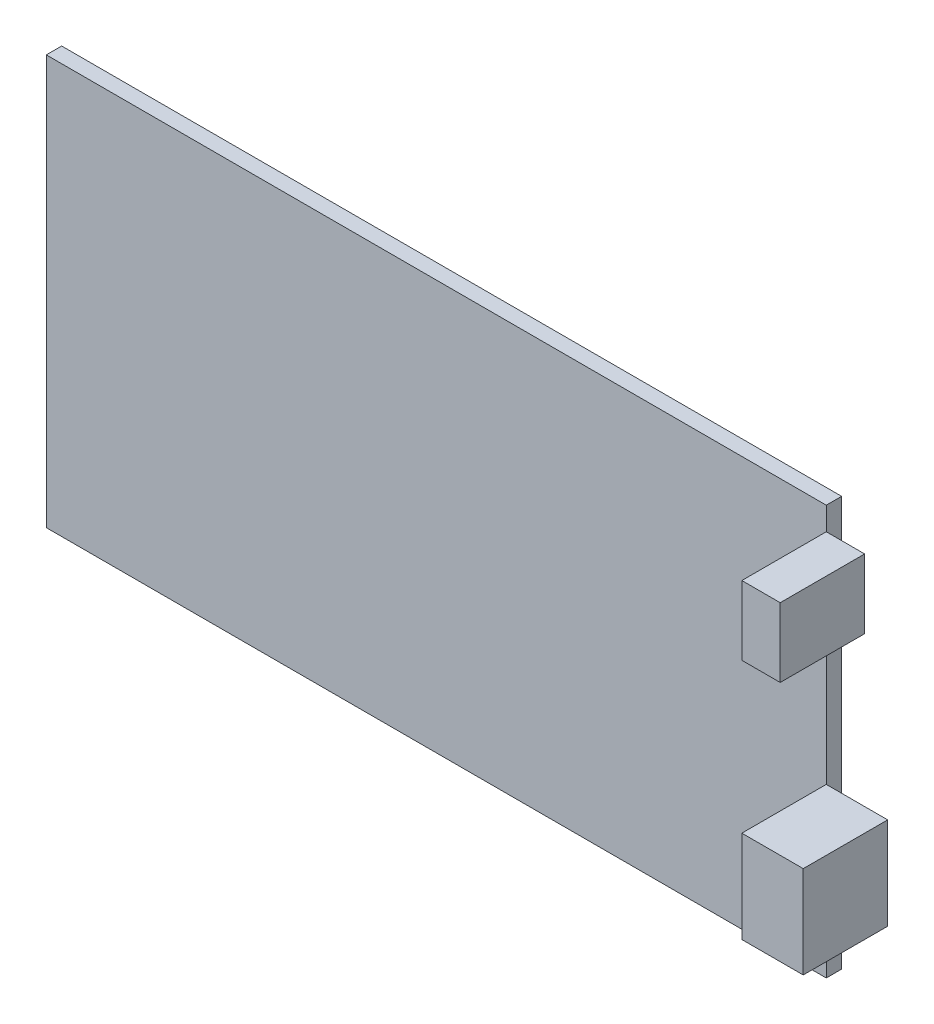
ISO-10303-21;
HEADER;
FILE_DESCRIPTION(('STEP AP214'),'2;1');
FILE_NAME('part.step','',(''),(''),'','','');
FILE_SCHEMA(('AUTOMOTIVE_DESIGN { 1 0 10303 214 1 1 1 1 }'));
ENDSEC;
DATA;
#1=APPLICATION_CONTEXT('core data for automotive mechanical design processes');
#2=APPLICATION_PROTOCOL_DEFINITION('international standard','automotive_design',2000,#1);
#3=PRODUCT_CONTEXT('',#1,'mechanical');
#4=PRODUCT('Part','Part','',(#3));
#5=PRODUCT_RELATED_PRODUCT_CATEGORY('part','',(#4));
#6=PRODUCT_DEFINITION_FORMATION('','',#4);
#7=PRODUCT_DEFINITION_CONTEXT('part definition',#1,'design');
#8=PRODUCT_DEFINITION('design','',#6,#7);
#9=PRODUCT_DEFINITION_SHAPE('','',#8);
#10=(LENGTH_UNIT() NAMED_UNIT(*) SI_UNIT(.MILLI.,.METRE.));
#11=(NAMED_UNIT(*) PLANE_ANGLE_UNIT() SI_UNIT($,.RADIAN.));
#12=(NAMED_UNIT(*) SI_UNIT($,.STERADIAN.) SOLID_ANGLE_UNIT());
#13=UNCERTAINTY_MEASURE_WITH_UNIT(LENGTH_MEASURE(1.E-05),#10,'distance_accuracy_value','');
#14=(GEOMETRIC_REPRESENTATION_CONTEXT(3) GLOBAL_UNCERTAINTY_ASSIGNED_CONTEXT((#13)) GLOBAL_UNIT_ASSIGNED_CONTEXT((#10,
#11,#12)) REPRESENTATION_CONTEXT('',''));
#15=CARTESIAN_POINT('',(0.,0.,0.));
#16=DIRECTION('',(0.,0.,1.));
#17=DIRECTION('',(1.,0.,0.));
#18=AXIS2_PLACEMENT_3D('',#15,#16,#17);
#19=CARTESIAN_POINT('',(106.6,21.84,2.));
#20=DIRECTION('',(0.,0.,1.));
#21=DIRECTION('',(0.,-1.,0.));
#22=AXIS2_PLACEMENT_3D('',#19,#20,#21);
#23=PLANE('',#22);
#24=DIRECTION('',(0.,1.,0.));
#25=VECTOR('',#24,1.);
#26=CARTESIAN_POINT('',(101.6,21.84,2.));
#27=LINE('',#26,#25);
#28=CARTESIAN_POINT('',(101.6,9.84,2.));
#29=VERTEX_POINT('',#28);
#30=CARTESIAN_POINT('',(101.6,21.84,2.));
#31=VERTEX_POINT('',#30);
#32=EDGE_CURVE('E120',#29,#31,#27,.T.);
#33=ORIENTED_EDGE('',*,*,#32,.T.);
#34=DIRECTION('',(-1.,0.,0.));
#35=VECTOR('',#34,1.);
#36=CARTESIAN_POINT('',(106.6,21.84,2.));
#37=LINE('',#36,#35);
#38=CARTESIAN_POINT('',(109.6,21.84,2.));
#39=VERTEX_POINT('',#38);
#40=EDGE_CURVE('E12',#39,#31,#37,.T.);
#41=ORIENTED_EDGE('',*,*,#40,.F.);
#42=DIRECTION('',(0.,1.,0.));
#43=VECTOR('',#42,1.);
#44=CARTESIAN_POINT('',(109.6,9.84,2.));
#45=LINE('',#44,#43);
#46=CARTESIAN_POINT('',(109.6,9.84,2.));
#47=VERTEX_POINT('',#46);
#48=EDGE_CURVE('E106',#47,#39,#45,.T.);
#49=ORIENTED_EDGE('',*,*,#48,.F.);
#50=DIRECTION('',(-1.,0.,0.));
#51=VECTOR('',#50,1.);
#52=CARTESIAN_POINT('',(106.6,9.84,2.));
#53=LINE('',#52,#51);
#54=EDGE_CURVE('E95',#47,#29,#53,.T.);
#55=ORIENTED_EDGE('',*,*,#54,.T.);
#56=EDGE_LOOP('',(#33,#41,#49,#55));
#57=FACE_BOUND('',#56,.T.);
#58=ADVANCED_FACE('F56',(#57),#23,.F.);
#59=CARTESIAN_POINT('',(106.6,21.84,2.));
#60=DIRECTION('',(0.,-1.,0.));
#61=DIRECTION('',(0.,0.,-1.));
#62=AXIS2_PLACEMENT_3D('',#59,#60,#61);
#63=PLANE('',#62);
#64=DIRECTION('',(0.,0.,1.));
#65=VECTOR('',#64,1.);
#66=CARTESIAN_POINT('',(101.6,21.84,2.));
#67=LINE('',#66,#65);
#68=CARTESIAN_POINT('',(101.6,21.84,13.));
#69=VERTEX_POINT('',#68);
#70=EDGE_CURVE('E122',#31,#69,#67,.T.);
#71=ORIENTED_EDGE('',*,*,#70,.T.);
#72=DIRECTION('',(-1.,0.,0.));
#73=VECTOR('',#72,1.);
#74=CARTESIAN_POINT('',(106.6,21.84,13.));
#75=LINE('',#74,#73);
#76=CARTESIAN_POINT('',(109.6,21.84,13.));
#77=VERTEX_POINT('',#76);
#78=EDGE_CURVE('E63',#77,#69,#75,.T.);
#79=ORIENTED_EDGE('',*,*,#78,.F.);
#80=DIRECTION('',(0.,0.,1.));
#81=VECTOR('',#80,1.);
#82=CARTESIAN_POINT('',(109.6,21.84,2.));
#83=LINE('',#82,#81);
#84=EDGE_CURVE('E110',#39,#77,#83,.T.);
#85=ORIENTED_EDGE('',*,*,#84,.F.);
#86=ORIENTED_EDGE('',*,*,#40,.T.);
#87=EDGE_LOOP('',(#71,#79,#85,#86));
#88=FACE_BOUND('',#87,.T.);
#89=ADVANCED_FACE('F130',(#88),#63,.F.);
#90=CARTESIAN_POINT('',(106.6,21.84,13.));
#91=DIRECTION('',(0.,0.,-1.));
#92=DIRECTION('',(0.,1.,0.));
#93=AXIS2_PLACEMENT_3D('',#90,#91,#92);
#94=PLANE('',#93);
#95=DIRECTION('',(0.,-1.,0.));
#96=VECTOR('',#95,1.);
#97=CARTESIAN_POINT('',(101.6,21.84,13.));
#98=LINE('',#97,#96);
#99=CARTESIAN_POINT('',(101.6,9.84,13.));
#100=VERTEX_POINT('',#99);
#101=EDGE_CURVE('E78',#69,#100,#98,.T.);
#102=ORIENTED_EDGE('',*,*,#101,.T.);
#103=DIRECTION('',(-1.,0.,0.));
#104=VECTOR('',#103,1.);
#105=CARTESIAN_POINT('',(106.6,9.84,13.));
#106=LINE('',#105,#104);
#107=CARTESIAN_POINT('',(109.6,9.84,13.));
#108=VERTEX_POINT('',#107);
#109=EDGE_CURVE('E103',#108,#100,#106,.T.);
#110=ORIENTED_EDGE('',*,*,#109,.F.);
#111=DIRECTION('',(0.,-1.,0.));
#112=VECTOR('',#111,1.);
#113=CARTESIAN_POINT('',(109.6,21.84,13.));
#114=LINE('',#113,#112);
#115=EDGE_CURVE('E115',#77,#108,#114,.T.);
#116=ORIENTED_EDGE('',*,*,#115,.F.);
#117=ORIENTED_EDGE('',*,*,#78,.T.);
#118=EDGE_LOOP('',(#102,#110,#116,#117));
#119=FACE_BOUND('',#118,.T.);
#120=ADVANCED_FACE('F126',(#119),#94,.F.);
#121=CARTESIAN_POINT('',(106.6,9.84,2.));
#122=DIRECTION('',(0.,1.,0.));
#123=DIRECTION('',(0.,0.,1.));
#124=AXIS2_PLACEMENT_3D('',#121,#122,#123);
#125=PLANE('',#124);
#126=DIRECTION('',(0.,0.,-1.));
#127=VECTOR('',#126,1.);
#128=CARTESIAN_POINT('',(101.6,9.84,2.));
#129=LINE('',#128,#127);
#130=EDGE_CURVE('E70',#100,#29,#129,.T.);
#131=ORIENTED_EDGE('',*,*,#130,.T.);
#132=ORIENTED_EDGE('',*,*,#54,.F.);
#133=DIRECTION('',(0.,0.,-1.));
#134=VECTOR('',#133,1.);
#135=CARTESIAN_POINT('',(109.6,9.84,13.));
#136=LINE('',#135,#134);
#137=EDGE_CURVE('E99',#108,#47,#136,.T.);
#138=ORIENTED_EDGE('',*,*,#137,.F.);
#139=ORIENTED_EDGE('',*,*,#109,.T.);
#140=EDGE_LOOP('',(#131,#132,#138,#139));
#141=FACE_BOUND('',#140,.T.);
#142=ADVANCED_FACE('F97',(#141),#125,.F.);
#143=CARTESIAN_POINT('',(101.6,0.,0.));
#144=DIRECTION('',(-1.,0.,0.));
#145=DIRECTION('',(0.,0.,1.));
#146=AXIS2_PLACEMENT_3D('',#143,#144,#145);
#147=PLANE('',#146);
#148=ORIENTED_EDGE('',*,*,#32,.F.);
#149=ORIENTED_EDGE('',*,*,#130,.F.);
#150=ORIENTED_EDGE('',*,*,#101,.F.);
#151=ORIENTED_EDGE('',*,*,#70,.F.);
#152=EDGE_LOOP('',(#148,#149,#150,#151));
#153=FACE_BOUND('',#152,.T.);
#154=ADVANCED_FACE('F129',(#153),#147,.T.);
#155=CARTESIAN_POINT('',(109.6,0.,0.));
#156=DIRECTION('',(1.,0.,0.));
#157=DIRECTION('',(0.,0.,-1.));
#158=AXIS2_PLACEMENT_3D('',#155,#156,#157);
#159=PLANE('',#158);
#160=ORIENTED_EDGE('',*,*,#137,.T.);
#161=ORIENTED_EDGE('',*,*,#48,.T.);
#162=ORIENTED_EDGE('',*,*,#84,.T.);
#163=ORIENTED_EDGE('',*,*,#115,.T.);
#164=EDGE_LOOP('',(#160,#161,#162,#163));
#165=FACE_BOUND('',#164,.T.);
#166=ADVANCED_FACE('F113',(#165),#159,.T.);
#167=CLOSED_SHELL('',(#58,#89,#120,#142,#154,#166));
#168=MANIFOLD_SOLID_BREP('B2',#167);
#169=CARTESIAN_POINT('',(106.6,50.34,2.));
#170=DIRECTION('',(0.,0.,1.));
#171=DIRECTION('',(0.,-1.,0.));
#172=AXIS2_PLACEMENT_3D('',#169,#170,#171);
#173=PLANE('',#172);
#174=DIRECTION('',(0.,1.,0.));
#175=VECTOR('',#174,1.);
#176=CARTESIAN_POINT('',(101.6,50.34,2.));
#177=LINE('',#176,#175);
#178=CARTESIAN_POINT('',(101.6,41.34,2.));
#179=VERTEX_POINT('',#178);
#180=CARTESIAN_POINT('',(101.6,50.34,2.));
#181=VERTEX_POINT('',#180);
#182=EDGE_CURVE('E264',#179,#181,#177,.T.);
#183=ORIENTED_EDGE('',*,*,#182,.T.);
#184=DIRECTION('',(-1.,0.,0.));
#185=VECTOR('',#184,1.);
#186=CARTESIAN_POINT('',(106.6,50.34,2.));
#187=LINE('',#186,#185);
#188=CARTESIAN_POINT('',(106.6,50.34,2.));
#189=VERTEX_POINT('',#188);
#190=EDGE_CURVE('E54',#189,#181,#187,.T.);
#191=ORIENTED_EDGE('',*,*,#190,.F.);
#192=DIRECTION('',(0.,1.,0.));
#193=VECTOR('',#192,1.);
#194=CARTESIAN_POINT('',(106.6,50.34,2.));
#195=LINE('',#194,#193);
#196=CARTESIAN_POINT('',(106.6,41.34,2.));
#197=VERTEX_POINT('',#196);
#198=EDGE_CURVE('E252',#197,#189,#195,.T.);
#199=ORIENTED_EDGE('',*,*,#198,.F.);
#200=DIRECTION('',(-1.,0.,0.));
#201=VECTOR('',#200,1.);
#202=CARTESIAN_POINT('',(106.6,41.34,2.));
#203=LINE('',#202,#201);
#204=EDGE_CURVE('E260',#197,#179,#203,.T.);
#205=ORIENTED_EDGE('',*,*,#204,.T.);
#206=EDGE_LOOP('',(#183,#191,#199,#205));
#207=FACE_BOUND('',#206,.T.);
#208=ADVANCED_FACE('F201',(#207),#173,.F.);
#209=CARTESIAN_POINT('',(106.6,50.34,2.));
#210=DIRECTION('',(0.,-1.,0.));
#211=DIRECTION('',(0.,0.,-1.));
#212=AXIS2_PLACEMENT_3D('',#209,#210,#211);
#213=PLANE('',#212);
#214=DIRECTION('',(0.,0.,1.));
#215=VECTOR('',#214,1.);
#216=CARTESIAN_POINT('',(101.6,50.34,2.));
#217=LINE('',#216,#215);
#218=CARTESIAN_POINT('',(101.6,50.34,13.));
#219=VERTEX_POINT('',#218);
#220=EDGE_CURVE('E256',#181,#219,#217,.T.);
#221=ORIENTED_EDGE('',*,*,#220,.T.);
#222=DIRECTION('',(-1.,0.,0.));
#223=VECTOR('',#222,1.);
#224=CARTESIAN_POINT('',(106.6,50.34,13.));
#225=LINE('',#224,#223);
#226=CARTESIAN_POINT('',(106.6,50.34,13.));
#227=VERTEX_POINT('',#226);
#228=EDGE_CURVE('E209',#227,#219,#225,.T.);
#229=ORIENTED_EDGE('',*,*,#228,.F.);
#230=DIRECTION('',(0.,0.,1.));
#231=VECTOR('',#230,1.);
#232=CARTESIAN_POINT('',(106.6,50.34,2.));
#233=LINE('',#232,#231);
#234=EDGE_CURVE('E247',#189,#227,#233,.T.);
#235=ORIENTED_EDGE('',*,*,#234,.F.);
#236=ORIENTED_EDGE('',*,*,#190,.T.);
#237=EDGE_LOOP('',(#221,#229,#235,#236));
#238=FACE_BOUND('',#237,.T.);
#239=ADVANCED_FACE('F255',(#238),#213,.F.);
#240=CARTESIAN_POINT('',(106.6,50.34,13.));
#241=DIRECTION('',(0.,0.,-1.));
#242=DIRECTION('',(-1.,0.,0.));
#243=AXIS2_PLACEMENT_3D('',#240,#241,#242);
#244=PLANE('',#243);
#245=DIRECTION('',(0.,-1.,0.));
#246=VECTOR('',#245,1.);
#247=CARTESIAN_POINT('',(101.6,50.34,13.));
#248=LINE('',#247,#246);
#249=CARTESIAN_POINT('',(101.6,41.34,13.));
#250=VERTEX_POINT('',#249);
#251=EDGE_CURVE('E234',#219,#250,#248,.T.);
#252=ORIENTED_EDGE('',*,*,#251,.T.);
#253=DIRECTION('',(-1.,0.,0.));
#254=VECTOR('',#253,1.);
#255=CARTESIAN_POINT('',(106.6,41.34,13.));
#256=LINE('',#255,#254);
#257=CARTESIAN_POINT('',(106.6,41.34,13.));
#258=VERTEX_POINT('',#257);
#259=EDGE_CURVE('E257',#258,#250,#256,.T.);
#260=ORIENTED_EDGE('',*,*,#259,.F.);
#261=DIRECTION('',(0.,-1.,0.));
#262=VECTOR('',#261,1.);
#263=CARTESIAN_POINT('',(106.6,50.34,13.));
#264=LINE('',#263,#262);
#265=EDGE_CURVE('E250',#227,#258,#264,.T.);
#266=ORIENTED_EDGE('',*,*,#265,.F.);
#267=ORIENTED_EDGE('',*,*,#228,.T.);
#268=EDGE_LOOP('',(#252,#260,#266,#267));
#269=FACE_BOUND('',#268,.T.);
#270=ADVANCED_FACE('F258',(#269),#244,.F.);
#271=CARTESIAN_POINT('',(106.6,41.34,2.));
#272=DIRECTION('',(0.,1.,0.));
#273=DIRECTION('',(0.,0.,1.));
#274=AXIS2_PLACEMENT_3D('',#271,#272,#273);
#275=PLANE('',#274);
#276=DIRECTION('',(0.,0.,-1.));
#277=VECTOR('',#276,1.);
#278=CARTESIAN_POINT('',(101.6,41.34,2.));
#279=LINE('',#278,#277);
#280=EDGE_CURVE('E240',#250,#179,#279,.T.);
#281=ORIENTED_EDGE('',*,*,#280,.T.);
#282=ORIENTED_EDGE('',*,*,#204,.F.);
#283=DIRECTION('',(0.,0.,-1.));
#284=VECTOR('',#283,1.);
#285=CARTESIAN_POINT('',(106.6,41.34,2.));
#286=LINE('',#285,#284);
#287=EDGE_CURVE('E217',#258,#197,#286,.T.);
#288=ORIENTED_EDGE('',*,*,#287,.F.);
#289=ORIENTED_EDGE('',*,*,#259,.T.);
#290=EDGE_LOOP('',(#281,#282,#288,#289));
#291=FACE_BOUND('',#290,.T.);
#292=ADVANCED_FACE('F271',(#291),#275,.F.);
#293=CARTESIAN_POINT('',(106.6,0.,0.));
#294=DIRECTION('',(-1.,0.,0.));
#295=DIRECTION('',(0.,0.,1.));
#296=AXIS2_PLACEMENT_3D('',#293,#294,#295);
#297=PLANE('',#296);
#298=ORIENTED_EDGE('',*,*,#198,.T.);
#299=ORIENTED_EDGE('',*,*,#234,.T.);
#300=ORIENTED_EDGE('',*,*,#265,.T.);
#301=ORIENTED_EDGE('',*,*,#287,.T.);
#302=EDGE_LOOP('',(#298,#299,#300,#301));
#303=FACE_BOUND('',#302,.T.);
#304=ADVANCED_FACE('F248',(#303),#297,.F.);
#305=CARTESIAN_POINT('',(101.6,0.,0.));
#306=DIRECTION('',(-1.,0.,0.));
#307=DIRECTION('',(0.,0.,1.));
#308=AXIS2_PLACEMENT_3D('',#305,#306,#307);
#309=PLANE('',#308);
#310=ORIENTED_EDGE('',*,*,#182,.F.);
#311=ORIENTED_EDGE('',*,*,#280,.F.);
#312=ORIENTED_EDGE('',*,*,#251,.F.);
#313=ORIENTED_EDGE('',*,*,#220,.F.);
#314=EDGE_LOOP('',(#310,#311,#312,#313));
#315=FACE_BOUND('',#314,.T.);
#316=ADVANCED_FACE('F274',(#315),#309,.T.);
#317=CLOSED_SHELL('',(#208,#239,#270,#292,#304,#316));
#318=MANIFOLD_SOLID_BREP('B6',#317);
#319=CARTESIAN_POINT('',(0.,0.,2.));
#320=DIRECTION('',(1.,0.,0.));
#321=DIRECTION('',(0.,0.,-1.));
#322=AXIS2_PLACEMENT_3D('',#319,#320,#321);
#323=PLANE('',#322);
#324=DIRECTION('',(0.,-1.,0.));
#325=VECTOR('',#324,1.);
#326=CARTESIAN_POINT('',(0.,0.,0.));
#327=LINE('',#326,#325);
#328=CARTESIAN_POINT('',(0.,53.34,0.));
#329=VERTEX_POINT('',#328);
#330=CARTESIAN_POINT('',(0.,0.,0.));
#331=VERTEX_POINT('',#330);
#332=EDGE_CURVE('E393',#329,#331,#327,.T.);
#333=ORIENTED_EDGE('',*,*,#332,.T.);
#334=DIRECTION('',(0.,0.,-1.));
#335=VECTOR('',#334,1.);
#336=CARTESIAN_POINT('',(0.,0.,2.));
#337=LINE('',#336,#335);
#338=CARTESIAN_POINT('',(0.,0.,2.));
#339=VERTEX_POINT('',#338);
#340=EDGE_CURVE('E199',#339,#331,#337,.T.);
#341=ORIENTED_EDGE('',*,*,#340,.F.);
#342=DIRECTION('',(0.,-1.,0.));
#343=VECTOR('',#342,1.);
#344=CARTESIAN_POINT('',(0.,0.,2.));
#345=LINE('',#344,#343);
#346=CARTESIAN_POINT('',(0.,53.34,2.));
#347=VERTEX_POINT('',#346);
#348=EDGE_CURVE('E377',#347,#339,#345,.T.);
#349=ORIENTED_EDGE('',*,*,#348,.F.);
#350=DIRECTION('',(0.,0.,-1.));
#351=VECTOR('',#350,1.);
#352=CARTESIAN_POINT('',(0.,53.34,2.));
#353=LINE('',#352,#351);
#354=EDGE_CURVE('E389',#347,#329,#353,.T.);
#355=ORIENTED_EDGE('',*,*,#354,.T.);
#356=EDGE_LOOP('',(#333,#341,#349,#355));
#357=FACE_BOUND('',#356,.T.);
#358=ADVANCED_FACE('F325',(#357),#323,.F.);
#359=CARTESIAN_POINT('',(0.,0.,2.));
#360=DIRECTION('',(0.,1.,0.));
#361=DIRECTION('',(0.,0.,1.));
#362=AXIS2_PLACEMENT_3D('',#359,#360,#361);
#363=PLANE('',#362);
#364=DIRECTION('',(1.,0.,0.));
#365=VECTOR('',#364,1.);
#366=CARTESIAN_POINT('',(0.,0.,0.));
#367=LINE('',#366,#365);
#368=CARTESIAN_POINT('',(101.6,0.,0.));
#369=VERTEX_POINT('',#368);
#370=EDGE_CURVE('E382',#331,#369,#367,.T.);
#371=ORIENTED_EDGE('',*,*,#370,.T.);
#372=DIRECTION('',(0.,0.,-1.));
#373=VECTOR('',#372,1.);
#374=CARTESIAN_POINT('',(101.6,0.,2.));
#375=LINE('',#374,#373);
#376=CARTESIAN_POINT('',(101.6,0.,2.));
#377=VERTEX_POINT('',#376);
#378=EDGE_CURVE('E334',#377,#369,#375,.T.);
#379=ORIENTED_EDGE('',*,*,#378,.F.);
#380=DIRECTION('',(1.,0.,0.));
#381=VECTOR('',#380,1.);
#382=CARTESIAN_POINT('',(0.,0.,2.));
#383=LINE('',#382,#381);
#384=EDGE_CURVE('E372',#339,#377,#383,.T.);
#385=ORIENTED_EDGE('',*,*,#384,.F.);
#386=ORIENTED_EDGE('',*,*,#340,.T.);
#387=EDGE_LOOP('',(#371,#379,#385,#386));
#388=FACE_BOUND('',#387,.T.);
#389=ADVANCED_FACE('F381',(#388),#363,.F.);
#390=CARTESIAN_POINT('',(101.6,0.,2.));
#391=DIRECTION('',(-1.,0.,0.));
#392=DIRECTION('',(0.,0.,1.));
#393=AXIS2_PLACEMENT_3D('',#390,#391,#392);
#394=PLANE('',#393);
#395=DIRECTION('',(0.,1.,0.));
#396=VECTOR('',#395,1.);
#397=CARTESIAN_POINT('',(101.6,0.,0.));
#398=LINE('',#397,#396);
#399=CARTESIAN_POINT('',(101.6,53.34,0.));
#400=VERTEX_POINT('',#399);
#401=EDGE_CURVE('E359',#369,#400,#398,.T.);
#402=ORIENTED_EDGE('',*,*,#401,.T.);
#403=DIRECTION('',(0.,0.,-1.));
#404=VECTOR('',#403,1.);
#405=CARTESIAN_POINT('',(101.6,53.34,2.));
#406=LINE('',#405,#404);
#407=CARTESIAN_POINT('',(101.6,53.34,2.));
#408=VERTEX_POINT('',#407);
#409=EDGE_CURVE('E384',#408,#400,#406,.T.);
#410=ORIENTED_EDGE('',*,*,#409,.F.);
#411=DIRECTION('',(0.,1.,0.));
#412=VECTOR('',#411,1.);
#413=CARTESIAN_POINT('',(101.6,0.,2.));
#414=LINE('',#413,#412);
#415=EDGE_CURVE('E375',#377,#408,#414,.T.);
#416=ORIENTED_EDGE('',*,*,#415,.F.);
#417=ORIENTED_EDGE('',*,*,#378,.T.);
#418=EDGE_LOOP('',(#402,#410,#416,#417));
#419=FACE_BOUND('',#418,.T.);
#420=ADVANCED_FACE('F385',(#419),#394,.F.);
#421=CARTESIAN_POINT('',(0.,53.34,2.));
#422=DIRECTION('',(0.,-1.,0.));
#423=DIRECTION('',(0.,0.,-1.));
#424=AXIS2_PLACEMENT_3D('',#421,#422,#423);
#425=PLANE('',#424);
#426=DIRECTION('',(-1.,0.,0.));
#427=VECTOR('',#426,1.);
#428=CARTESIAN_POINT('',(0.,53.34,0.));
#429=LINE('',#428,#427);
#430=EDGE_CURVE('E365',#400,#329,#429,.T.);
#431=ORIENTED_EDGE('',*,*,#430,.T.);
#432=ORIENTED_EDGE('',*,*,#354,.F.);
#433=DIRECTION('',(-1.,0.,0.));
#434=VECTOR('',#433,1.);
#435=CARTESIAN_POINT('',(0.,53.34,2.));
#436=LINE('',#435,#434);
#437=EDGE_CURVE('E342',#408,#347,#436,.T.);
#438=ORIENTED_EDGE('',*,*,#437,.F.);
#439=ORIENTED_EDGE('',*,*,#409,.T.);
#440=EDGE_LOOP('',(#431,#432,#438,#439));
#441=FACE_BOUND('',#440,.T.);
#442=ADVANCED_FACE('F406',(#441),#425,.F.);
#443=CARTESIAN_POINT('',(0.,0.,2.));
#444=DIRECTION('',(0.,0.,-1.));
#445=DIRECTION('',(-1.,0.,0.));
#446=AXIS2_PLACEMENT_3D('',#443,#444,#445);
#447=PLANE('',#446);
#448=ORIENTED_EDGE('',*,*,#348,.T.);
#449=ORIENTED_EDGE('',*,*,#384,.T.);
#450=ORIENTED_EDGE('',*,*,#415,.T.);
#451=ORIENTED_EDGE('',*,*,#437,.T.);
#452=EDGE_LOOP('',(#448,#449,#450,#451));
#453=FACE_BOUND('',#452,.T.);
#454=ADVANCED_FACE('F373',(#453),#447,.F.);
#455=CARTESIAN_POINT('',(0.,0.,0.));
#456=DIRECTION('',(0.,0.,-1.));
#457=DIRECTION('',(-1.,0.,0.));
#458=AXIS2_PLACEMENT_3D('',#455,#456,#457);
#459=PLANE('',#458);
#460=ORIENTED_EDGE('',*,*,#332,.F.);
#461=ORIENTED_EDGE('',*,*,#430,.F.);
#462=ORIENTED_EDGE('',*,*,#401,.F.);
#463=ORIENTED_EDGE('',*,*,#370,.F.);
#464=EDGE_LOOP('',(#460,#461,#462,#463));
#465=FACE_BOUND('',#464,.T.);
#466=ADVANCED_FACE('F409',(#465),#459,.T.);
#467=CLOSED_SHELL('',(#358,#389,#420,#442,#454,#466));
#468=MANIFOLD_SOLID_BREP('B48',#467);
#469=ADVANCED_BREP_SHAPE_REPRESENTATION('',(#18,#168,#318,#468),#14);
#470=SHAPE_DEFINITION_REPRESENTATION(#9,#469);
ENDSEC;
END-ISO-10303-21;
